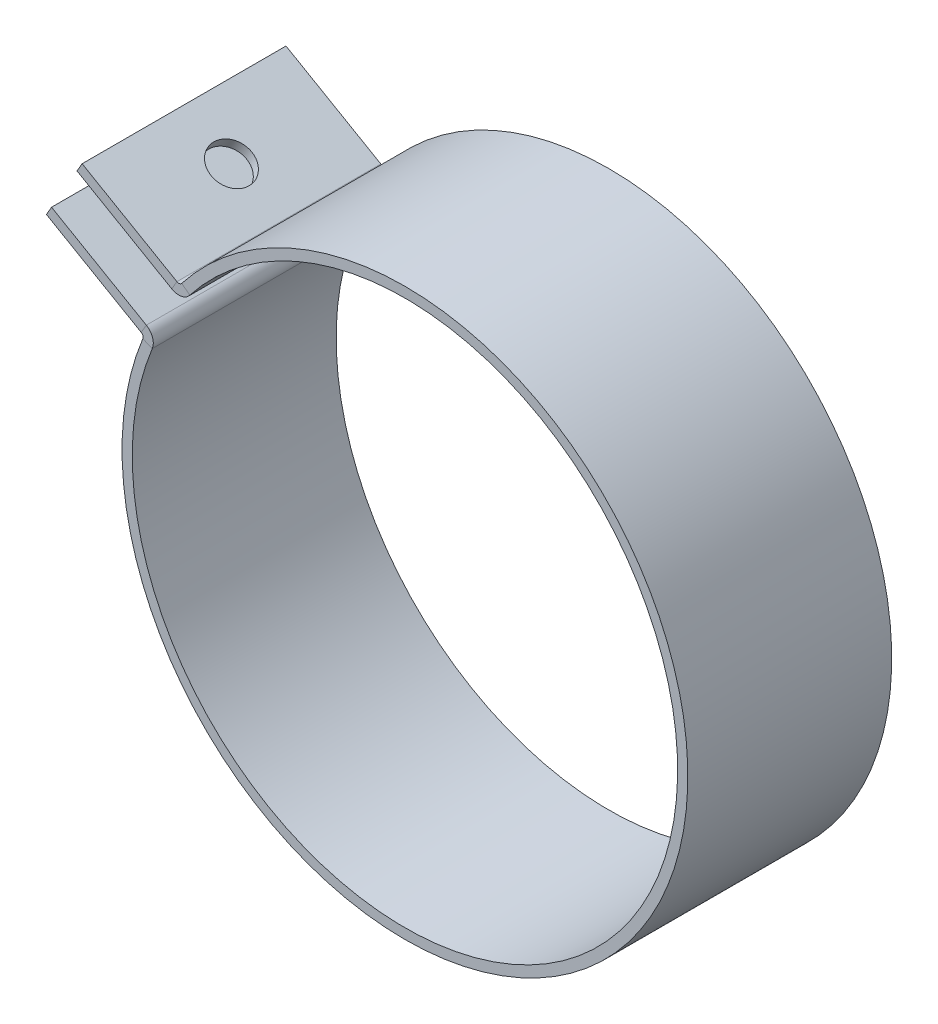
ISO-10303-21;
HEADER;
FILE_DESCRIPTION(('STEP AP214'),'2;1');
FILE_NAME('part.step','',(''),(''),'','','');
FILE_SCHEMA(('AUTOMOTIVE_DESIGN { 1 0 10303 214 1 1 1 1 }'));
ENDSEC;
DATA;
#1=APPLICATION_CONTEXT('core data for automotive mechanical design processes');
#2=APPLICATION_PROTOCOL_DEFINITION('international standard','automotive_design',2000,#1);
#3=PRODUCT_CONTEXT('',#1,'mechanical');
#4=PRODUCT('Part','Part','',(#3));
#5=PRODUCT_RELATED_PRODUCT_CATEGORY('part','',(#4));
#6=PRODUCT_DEFINITION_FORMATION('','',#4);
#7=PRODUCT_DEFINITION_CONTEXT('part definition',#1,'design');
#8=PRODUCT_DEFINITION('design','',#6,#7);
#9=PRODUCT_DEFINITION_SHAPE('','',#8);
#10=(LENGTH_UNIT() NAMED_UNIT(*) SI_UNIT(.MILLI.,.METRE.));
#11=(NAMED_UNIT(*) PLANE_ANGLE_UNIT() SI_UNIT($,.RADIAN.));
#12=(NAMED_UNIT(*) SI_UNIT($,.STERADIAN.) SOLID_ANGLE_UNIT());
#13=UNCERTAINTY_MEASURE_WITH_UNIT(LENGTH_MEASURE(1.E-05),#10,'distance_accuracy_value','');
#14=(GEOMETRIC_REPRESENTATION_CONTEXT(3) GLOBAL_UNCERTAINTY_ASSIGNED_CONTEXT((#13)) GLOBAL_UNIT_ASSIGNED_CONTEXT((#10,
#11,#12)) REPRESENTATION_CONTEXT('',''));
#15=CARTESIAN_POINT('',(0.,0.,0.));
#16=DIRECTION('',(0.,0.,1.));
#17=DIRECTION('',(1.,0.,0.));
#18=AXIS2_PLACEMENT_3D('',#15,#16,#17);
#19=CARTESIAN_POINT('',(-45.7392490613195,167.18107044998,40.));
#20=DIRECTION('',(0.,0.,1.));
#21=DIRECTION('',(1.,0.,0.));
#22=AXIS2_PLACEMENT_3D('',#19,#20,#21);
#23=PLANE('',#22);
#24=DIRECTION('',(0.499999999999991,0.866025403784444,0.));
#25=VECTOR('',#24,1.);
#26=CARTESIAN_POINT('',(-45.7392490613195,167.18107044998,40.));
#27=LINE('',#26,#25);
#28=CARTESIAN_POINT('',(-45.7392490613195,167.18107044998,40.));
#29=VERTEX_POINT('',#28);
#30=CARTESIAN_POINT('',(-44.7392490613195,168.913121257549,40.));
#31=VERTEX_POINT('',#30);
#32=EDGE_CURVE('E13',#29,#31,#27,.T.);
#33=ORIENTED_EDGE('',*,*,#32,.F.);
#34=CARTESIAN_POINT('',(-44.3709490613195,169.551035569977,40.));
#35=DIRECTION('',(0.,0.,1.));
#36=DIRECTION('',(1.,0.,0.));
#37=AXIS2_PLACEMENT_3D('',#34,#35,#36);
#38=CIRCLE('',#37,2.7366);
#39=CARTESIAN_POINT('',(-42.2117584416659,167.86970412496,40.));
#40=VERTEX_POINT('',#39);
#41=EDGE_CURVE('E258',#40,#29,#38,.F.);
#42=ORIENTED_EDGE('',*,*,#41,.F.);
#43=DIRECTION('',(0.789004830685348,-0.614386992989911,0.));
#44=VECTOR('',#43,1.);
#45=CARTESIAN_POINT('',(-43.7897681030368,169.09847811094,40.));
#46=LINE('',#45,#44);
#47=CARTESIAN_POINT('',(-43.7897681030368,169.09847811094,40.));
#48=VERTEX_POINT('',#47);
#49=EDGE_CURVE('E59',#48,#40,#46,.T.);
#50=ORIENTED_EDGE('',*,*,#49,.F.);
#51=CARTESIAN_POINT('',(-44.3709490613195,169.551035569977,40.));
#52=DIRECTION('',(0.,0.,1.));
#53=DIRECTION('',(1.,0.,0.));
#54=AXIS2_PLACEMENT_3D('',#51,#52,#53);
#55=CIRCLE('',#54,0.7366);
#56=EDGE_CURVE('E183',#48,#31,#55,.F.);
#57=ORIENTED_EDGE('',*,*,#56,.T.);
#58=EDGE_LOOP('',(#33,#42,#50,#57));
#59=FACE_BOUND('',#58,.T.);
#60=ADVANCED_FACE('F50',(#59),#23,.T.);
#61=CARTESIAN_POINT('',(-43.7897681030368,169.09847811094,40.));
#62=DIRECTION('',(0.,0.,1.));
#63=DIRECTION('',(1.,0.,0.));
#64=AXIS2_PLACEMENT_3D('',#61,#62,#63);
#65=PLANE('',#64);
#66=DIRECTION('',(-0.866025403784444,0.49999999999999,0.));
#67=VECTOR('',#66,1.);
#68=CARTESIAN_POINT('',(-43.6295729440455,165.963048375769,40.));
#69=LINE('',#68,#67);
#70=CARTESIAN_POINT('',(-64.3363094478901,177.918088270302,40.));
#71=VERTEX_POINT('',#70);
#72=EDGE_CURVE('E262',#29,#71,#69,.T.);
#73=ORIENTED_EDGE('',*,*,#72,.F.);
#74=ORIENTED_EDGE('',*,*,#32,.T.);
#75=DIRECTION('',(-0.866025403784444,0.49999999999999,0.));
#76=VECTOR('',#75,1.);
#77=CARTESIAN_POINT('',(-42.6295729440455,167.695099183338,40.));
#78=LINE('',#77,#76);
#79=CARTESIAN_POINT('',(-63.3363094478903,179.650139077871,40.));
#80=VERTEX_POINT('',#79);
#81=EDGE_CURVE('E119',#31,#80,#78,.T.);
#82=ORIENTED_EDGE('',*,*,#81,.T.);
#83=DIRECTION('',(0.499999999999993,0.866025403784442,0.));
#84=VECTOR('',#83,1.);
#85=CARTESIAN_POINT('',(-64.3363094478901,177.918088270302,40.));
#86=LINE('',#85,#84);
#87=EDGE_CURVE('E500',#71,#80,#86,.T.);
#88=ORIENTED_EDGE('',*,*,#87,.F.);
#89=EDGE_LOOP('',(#73,#74,#82,#88));
#90=FACE_BOUND('',#89,.T.);
#91=ADVANCED_FACE('F311',(#90),#65,.T.);
#92=CARTESIAN_POINT('',(-42.2117584416659,167.86970412496,0.));
#93=DIRECTION('',(0.,0.,-1.));
#94=DIRECTION('',(-1.,0.,0.));
#95=AXIS2_PLACEMENT_3D('',#92,#93,#94);
#96=PLANE('',#95);
#97=DIRECTION('',(-0.789004830685348,0.614386992989911,0.));
#98=VECTOR('',#97,1.);
#99=CARTESIAN_POINT('',(-42.2117584416659,167.86970412496,0.));
#100=LINE('',#99,#98);
#101=CARTESIAN_POINT('',(-42.2117584416659,167.86970412496,0.));
#102=VERTEX_POINT('',#101);
#103=CARTESIAN_POINT('',(-43.7897681030368,169.09847811094,0.));
#104=VERTEX_POINT('',#103);
#105=EDGE_CURVE('E106',#102,#104,#100,.T.);
#106=ORIENTED_EDGE('',*,*,#105,.F.);
#107=CARTESIAN_POINT('',(-44.3709490613195,169.551035569977,0.));
#108=DIRECTION('',(0.,0.,1.));
#109=DIRECTION('',(1.,0.,0.));
#110=AXIS2_PLACEMENT_3D('',#107,#108,#109);
#111=CIRCLE('',#110,2.7366);
#112=CARTESIAN_POINT('',(-45.7392490613195,167.18107044998,0.));
#113=VERTEX_POINT('',#112);
#114=EDGE_CURVE('E199',#102,#113,#111,.F.);
#115=ORIENTED_EDGE('',*,*,#114,.T.);
#116=DIRECTION('',(-0.499999999999991,-0.866025403784444,0.));
#117=VECTOR('',#116,1.);
#118=CARTESIAN_POINT('',(-44.7392490613195,168.913121257549,0.));
#119=LINE('',#118,#117);
#120=CARTESIAN_POINT('',(-44.7392490613195,168.913121257549,0.));
#121=VERTEX_POINT('',#120);
#122=EDGE_CURVE('E113',#121,#113,#119,.T.);
#123=ORIENTED_EDGE('',*,*,#122,.F.);
#124=CARTESIAN_POINT('',(-44.3709490613195,169.551035569977,0.));
#125=DIRECTION('',(0.,0.,1.));
#126=DIRECTION('',(1.,0.,0.));
#127=AXIS2_PLACEMENT_3D('',#124,#125,#126);
#128=CIRCLE('',#127,0.7366);
#129=EDGE_CURVE('E218',#104,#121,#128,.F.);
#130=ORIENTED_EDGE('',*,*,#129,.F.);
#131=EDGE_LOOP('',(#106,#115,#123,#130));
#132=FACE_BOUND('',#131,.T.);
#133=ADVANCED_FACE('F315',(#132),#96,.T.);
#134=CARTESIAN_POINT('',(-44.7392490613195,168.913121257549,0.));
#135=DIRECTION('',(0.,0.,-1.));
#136=DIRECTION('',(-1.,0.,0.));
#137=AXIS2_PLACEMENT_3D('',#134,#135,#136);
#138=PLANE('',#137);
#139=CARTESIAN_POINT('',(0.,135.,0.));
#140=DIRECTION('',(0.,0.,1.));
#141=DIRECTION('',(1.,0.,0.));
#142=AXIS2_PLACEMENT_3D('',#139,#140,#141);
#143=CIRCLE('',#142,53.5);
#144=CARTESIAN_POINT('',(-49.5718780079271,155.121603086414,0.));
#145=VERTEX_POINT('',#144);
#146=EDGE_CURVE('E201',#145,#102,#143,.T.);
#147=ORIENTED_EDGE('',*,*,#146,.T.);
#148=ORIENTED_EDGE('',*,*,#105,.T.);
#149=CARTESIAN_POINT('',(0.,135.,0.));
#150=DIRECTION('',(0.,0.,1.));
#151=DIRECTION('',(1.,0.,0.));
#152=AXIS2_PLACEMENT_3D('',#149,#150,#151);
#153=CIRCLE('',#152,55.5);
#154=CARTESIAN_POINT('',(-51.4250323259805,155.873812547589,0.));
#155=VERTEX_POINT('',#154);
#156=EDGE_CURVE('E216',#155,#104,#153,.T.);
#157=ORIENTED_EDGE('',*,*,#156,.F.);
#158=DIRECTION('',(0.926577159026677,-0.376104730587175,0.));
#159=VECTOR('',#158,1.);
#160=CARTESIAN_POINT('',(-51.4250323259805,155.873812547589,0.));
#161=LINE('',#160,#159);
#162=EDGE_CURVE('E244',#155,#145,#161,.T.);
#163=ORIENTED_EDGE('',*,*,#162,.T.);
#164=EDGE_LOOP('',(#147,#148,#157,#163));
#165=FACE_BOUND('',#164,.T.);
#166=ADVANCED_FACE('F288',(#165),#138,.T.);
#167=CARTESIAN_POINT('',(-49.5718780079271,155.121603086414,40.));
#168=DIRECTION('',(0.,0.,1.));
#169=DIRECTION('',(1.,0.,0.));
#170=AXIS2_PLACEMENT_3D('',#167,#168,#169);
#171=PLANE('',#170);
#172=DIRECTION('',(-0.926577159026677,0.376104730587175,0.));
#173=VECTOR('',#172,1.);
#174=CARTESIAN_POINT('',(-49.5718780079271,155.121603086414,40.));
#175=LINE('',#174,#173);
#176=CARTESIAN_POINT('',(-49.5718780079271,155.121603086414,40.));
#177=VERTEX_POINT('',#176);
#178=CARTESIAN_POINT('',(-51.4250323259805,155.873812547589,40.));
#179=VERTEX_POINT('',#178);
#180=EDGE_CURVE('E147',#177,#179,#175,.T.);
#181=ORIENTED_EDGE('',*,*,#180,.F.);
#182=CARTESIAN_POINT('',(-52.1075490613195,156.150851292139,40.));
#183=DIRECTION('',(0.,0.,1.));
#184=DIRECTION('',(1.,0.,0.));
#185=AXIS2_PLACEMENT_3D('',#182,#183,#184);
#186=CIRCLE('',#185,2.7366);
#187=CARTESIAN_POINT('',(-50.7392490613195,158.520816412136,40.));
#188=VERTEX_POINT('',#187);
#189=EDGE_CURVE('E265',#188,#177,#186,.F.);
#190=ORIENTED_EDGE('',*,*,#189,.F.);
#191=DIRECTION('',(0.499999999999999,0.866025403784439,0.));
#192=VECTOR('',#191,1.);
#193=CARTESIAN_POINT('',(-51.7392490613195,156.788765604567,40.));
#194=LINE('',#193,#192);
#195=CARTESIAN_POINT('',(-51.7392490613195,156.788765604567,40.));
#196=VERTEX_POINT('',#195);
#197=EDGE_CURVE('E159',#196,#188,#194,.T.);
#198=ORIENTED_EDGE('',*,*,#197,.F.);
#199=CARTESIAN_POINT('',(-52.1075490613195,156.150851292139,40.));
#200=DIRECTION('',(0.,0.,1.));
#201=DIRECTION('',(1.,0.,0.));
#202=AXIS2_PLACEMENT_3D('',#199,#200,#201);
#203=CIRCLE('',#202,0.7366);
#204=EDGE_CURVE('E162',#196,#179,#203,.F.);
#205=ORIENTED_EDGE('',*,*,#204,.T.);
#206=EDGE_LOOP('',(#181,#190,#198,#205));
#207=FACE_BOUND('',#206,.T.);
#208=ADVANCED_FACE('F164',(#207),#171,.T.);
#209=CARTESIAN_POINT('',(-51.7392490613195,156.788765604567,40.));
#210=DIRECTION('',(0.,0.,1.));
#211=DIRECTION('',(1.,0.,0.));
#212=AXIS2_PLACEMENT_3D('',#209,#210,#211);
#213=PLANE('',#212);
#214=CARTESIAN_POINT('',(0.,135.,40.));
#215=DIRECTION('',(0.,0.,1.));
#216=DIRECTION('',(1.,0.,0.));
#217=AXIS2_PLACEMENT_3D('',#214,#215,#216);
#218=CIRCLE('',#217,53.5);
#219=EDGE_CURVE('E154',#177,#40,#218,.T.);
#220=ORIENTED_EDGE('',*,*,#219,.F.);
#221=ORIENTED_EDGE('',*,*,#180,.T.);
#222=CARTESIAN_POINT('',(0.,135.,40.));
#223=DIRECTION('',(0.,0.,1.));
#224=DIRECTION('',(1.,0.,0.));
#225=AXIS2_PLACEMENT_3D('',#222,#223,#224);
#226=CIRCLE('',#225,55.5);
#227=EDGE_CURVE('E151',#179,#48,#226,.T.);
#228=ORIENTED_EDGE('',*,*,#227,.T.);
#229=ORIENTED_EDGE('',*,*,#49,.T.);
#230=EDGE_LOOP('',(#220,#221,#228,#229));
#231=FACE_BOUND('',#230,.T.);
#232=ADVANCED_FACE('F149',(#231),#213,.T.);
#233=CARTESIAN_POINT('',(-50.7392490613195,158.520816412136,0.));
#234=DIRECTION('',(0.,0.,-1.));
#235=DIRECTION('',(-1.,0.,0.));
#236=AXIS2_PLACEMENT_3D('',#233,#234,#235);
#237=PLANE('',#236);
#238=DIRECTION('',(-0.499999999999999,-0.866025403784439,0.));
#239=VECTOR('',#238,1.);
#240=CARTESIAN_POINT('',(-50.7392490613195,158.520816412136,0.));
#241=LINE('',#240,#239);
#242=CARTESIAN_POINT('',(-50.7392490613195,158.520816412136,0.));
#243=VERTEX_POINT('',#242);
#244=CARTESIAN_POINT('',(-51.7392490613195,156.788765604567,0.));
#245=VERTEX_POINT('',#244);
#246=EDGE_CURVE('E246',#243,#245,#241,.T.);
#247=ORIENTED_EDGE('',*,*,#246,.F.);
#248=CARTESIAN_POINT('',(-52.1075490613195,156.150851292139,0.));
#249=DIRECTION('',(0.,0.,1.));
#250=DIRECTION('',(1.,0.,0.));
#251=AXIS2_PLACEMENT_3D('',#248,#249,#250);
#252=CIRCLE('',#251,2.7366);
#253=EDGE_CURVE('E203',#243,#145,#252,.F.);
#254=ORIENTED_EDGE('',*,*,#253,.T.);
#255=ORIENTED_EDGE('',*,*,#162,.F.);
#256=CARTESIAN_POINT('',(-52.1075490613195,156.150851292139,0.));
#257=DIRECTION('',(0.,0.,1.));
#258=DIRECTION('',(1.,0.,0.));
#259=AXIS2_PLACEMENT_3D('',#256,#257,#258);
#260=CIRCLE('',#259,0.7366);
#261=EDGE_CURVE('E175',#245,#155,#260,.F.);
#262=ORIENTED_EDGE('',*,*,#261,.F.);
#263=EDGE_LOOP('',(#247,#254,#255,#262));
#264=FACE_BOUND('',#263,.T.);
#265=ADVANCED_FACE('F286',(#264),#237,.T.);
#266=CARTESIAN_POINT('',(-51.4250323259805,155.873812547589,0.));
#267=DIRECTION('',(0.,0.,-1.));
#268=DIRECTION('',(-1.,0.,0.));
#269=AXIS2_PLACEMENT_3D('',#266,#267,#268);
#270=PLANE('',#269);
#271=DIRECTION('',(0.86602540378444,-0.499999999999997,0.));
#272=VECTOR('',#271,1.);
#273=CARTESIAN_POINT('',(-69.3363094478902,169.257834232458,0.));
#274=LINE('',#273,#272);
#275=CARTESIAN_POINT('',(-69.3363094478902,169.257834232458,0.));
#276=VERTEX_POINT('',#275);
#277=EDGE_CURVE('E206',#276,#243,#274,.T.);
#278=ORIENTED_EDGE('',*,*,#277,.T.);
#279=ORIENTED_EDGE('',*,*,#246,.T.);
#280=DIRECTION('',(0.86602540378444,-0.499999999999997,0.));
#281=VECTOR('',#280,1.);
#282=CARTESIAN_POINT('',(-70.3363094478902,167.525783424889,0.));
#283=LINE('',#282,#281);
#284=CARTESIAN_POINT('',(-70.3363094478902,167.525783424889,0.));
#285=VERTEX_POINT('',#284);
#286=EDGE_CURVE('E212',#285,#245,#283,.T.);
#287=ORIENTED_EDGE('',*,*,#286,.F.);
#288=DIRECTION('',(0.499999999999998,0.866025403784439,0.));
#289=VECTOR('',#288,1.);
#290=CARTESIAN_POINT('',(-70.3363094478902,167.525783424889,0.));
#291=LINE('',#290,#289);
#292=EDGE_CURVE('E209',#285,#276,#291,.T.);
#293=ORIENTED_EDGE('',*,*,#292,.T.);
#294=EDGE_LOOP('',(#278,#279,#287,#293));
#295=FACE_BOUND('',#294,.T.);
#296=ADVANCED_FACE('F298',(#295),#270,.T.);
#297=CARTESIAN_POINT('',(-42.6295729440455,167.695099183338,40.));
#298=DIRECTION('',(-0.49999999999999,-0.866025403784444,0.));
#299=DIRECTION('',(0.866025403784444,-0.49999999999999,0.));
#300=AXIS2_PLACEMENT_3D('',#297,#298,#299);
#301=PLANE('',#300);
#302=CARTESIAN_POINT('',(-54.0377792546047,174.28163016771,20.));
#303=DIRECTION('',(0.499999999999992,0.866025403784443,0.));
#304=DIRECTION('',(-0.866025403784443,0.499999999999992,0.));
#305=AXIS2_PLACEMENT_3D('',#302,#303,#304);
#306=CIRCLE('',#305,3.99999999999998);
#307=CARTESIAN_POINT('',(-57.5018808697425,176.28163016771,20.));
#308=VERTEX_POINT('',#307);
#309=EDGE_CURVE('E491',#308,#308,#306,.T.);
#310=ORIENTED_EDGE('',*,*,#309,.F.);
#311=EDGE_LOOP('',(#310));
#312=FACE_BOUND('',#311,.T.);
#313=DIRECTION('',(-0.866025403784444,0.49999999999999,0.));
#314=VECTOR('',#313,1.);
#315=CARTESIAN_POINT('',(-42.6295729440455,167.695099183338,0.));
#316=LINE('',#315,#314);
#317=CARTESIAN_POINT('',(-63.3363094478903,179.650139077871,0.));
#318=VERTEX_POINT('',#317);
#319=EDGE_CURVE('E189',#121,#318,#316,.T.);
#320=ORIENTED_EDGE('',*,*,#319,.T.);
#321=DIRECTION('',(0.,0.,-1.));
#322=VECTOR('',#321,1.);
#323=CARTESIAN_POINT('',(-63.3363094478903,179.650139077871,40.));
#324=LINE('',#323,#322);
#325=EDGE_CURVE('E242',#80,#318,#324,.T.);
#326=ORIENTED_EDGE('',*,*,#325,.F.);
#327=ORIENTED_EDGE('',*,*,#81,.F.);
#328=DIRECTION('',(0.,0.,-1.));
#329=VECTOR('',#328,1.);
#330=CARTESIAN_POINT('',(-44.7392490613195,168.913121257549,40.));
#331=LINE('',#330,#329);
#332=EDGE_CURVE('E185',#31,#121,#331,.T.);
#333=ORIENTED_EDGE('',*,*,#332,.T.);
#334=EDGE_LOOP('',(#320,#326,#327,#333));
#335=FACE_BOUND('',#334,.T.);
#336=ADVANCED_FACE('F300',(#312,#335),#301,.F.);
#337=CARTESIAN_POINT('',(-64.3363094478901,177.918088270302,40.));
#338=DIRECTION('',(-0.866025403784442,0.499999999999993,0.));
#339=DIRECTION('',(-0.499999999999993,-0.866025403784442,0.));
#340=AXIS2_PLACEMENT_3D('',#337,#338,#339);
#341=PLANE('',#340);
#342=DIRECTION('',(0.499999999999993,0.866025403784442,0.));
#343=VECTOR('',#342,1.);
#344=CARTESIAN_POINT('',(-64.3363094478901,177.918088270302,0.));
#345=LINE('',#344,#343);
#346=CARTESIAN_POINT('',(-64.3363094478901,177.918088270302,0.));
#347=VERTEX_POINT('',#346);
#348=EDGE_CURVE('E192',#347,#318,#345,.T.);
#349=ORIENTED_EDGE('',*,*,#348,.F.);
#350=DIRECTION('',(0.,0.,-1.));
#351=VECTOR('',#350,1.);
#352=CARTESIAN_POINT('',(-64.3363094478901,177.918088270302,40.));
#353=LINE('',#352,#351);
#354=EDGE_CURVE('E240',#71,#347,#353,.T.);
#355=ORIENTED_EDGE('',*,*,#354,.F.);
#356=ORIENTED_EDGE('',*,*,#87,.T.);
#357=ORIENTED_EDGE('',*,*,#325,.T.);
#358=EDGE_LOOP('',(#349,#355,#356,#357));
#359=FACE_BOUND('',#358,.T.);
#360=ADVANCED_FACE('F306',(#359),#341,.T.);
#361=CARTESIAN_POINT('',(-43.6295729440455,165.963048375769,40.));
#362=DIRECTION('',(-0.49999999999999,-0.866025403784444,0.));
#363=DIRECTION('',(0.866025403784444,-0.49999999999999,0.));
#364=AXIS2_PLACEMENT_3D('',#361,#362,#363);
#365=PLANE('',#364);
#366=CARTESIAN_POINT('',(-55.0377792546048,172.549579360141,20.));
#367=DIRECTION('',(-0.49999999999999,-0.866025403784444,0.));
#368=DIRECTION('',(0.866025403784444,-0.49999999999999,0.));
#369=AXIS2_PLACEMENT_3D('',#366,#367,#368);
#370=CIRCLE('',#369,3.99999999999998);
#371=CARTESIAN_POINT('',(-51.5736776394671,170.549579360141,20.));
#372=VERTEX_POINT('',#371);
#373=EDGE_CURVE('E193',#372,#372,#370,.T.);
#374=ORIENTED_EDGE('',*,*,#373,.F.);
#375=EDGE_LOOP('',(#374));
#376=FACE_BOUND('',#375,.T.);
#377=DIRECTION('',(-0.866025403784444,0.49999999999999,0.));
#378=VECTOR('',#377,1.);
#379=CARTESIAN_POINT('',(-43.6295729440455,165.963048375769,0.));
#380=LINE('',#379,#378);
#381=EDGE_CURVE('E196',#113,#347,#380,.T.);
#382=ORIENTED_EDGE('',*,*,#381,.F.);
#383=DIRECTION('',(0.,0.,-1.));
#384=VECTOR('',#383,1.);
#385=CARTESIAN_POINT('',(-45.7392490613195,167.18107044998,40.));
#386=LINE('',#385,#384);
#387=EDGE_CURVE('E237',#29,#113,#386,.T.);
#388=ORIENTED_EDGE('',*,*,#387,.F.);
#389=ORIENTED_EDGE('',*,*,#72,.T.);
#390=ORIENTED_EDGE('',*,*,#354,.T.);
#391=EDGE_LOOP('',(#382,#388,#389,#390));
#392=FACE_BOUND('',#391,.T.);
#393=ADVANCED_FACE('F358',(#376,#392),#365,.T.);
#394=CARTESIAN_POINT('',(-44.3709490613195,169.551035569977,40.));
#395=DIRECTION('',(0.,0.,-1.));
#396=DIRECTION('',(-1.,0.,0.));
#397=AXIS2_PLACEMENT_3D('',#394,#395,#396);
#398=CYLINDRICAL_SURFACE('',#397,2.7366);
#399=ORIENTED_EDGE('',*,*,#114,.F.);
#400=DIRECTION('',(0.,0.,-1.));
#401=VECTOR('',#400,1.);
#402=CARTESIAN_POINT('',(-42.2117584416659,167.86970412496,40.));
#403=LINE('',#402,#401);
#404=EDGE_CURVE('E234',#40,#102,#403,.T.);
#405=ORIENTED_EDGE('',*,*,#404,.F.);
#406=ORIENTED_EDGE('',*,*,#41,.T.);
#407=ORIENTED_EDGE('',*,*,#387,.T.);
#408=EDGE_LOOP('',(#399,#405,#406,#407));
#409=FACE_BOUND('',#408,.T.);
#410=ADVANCED_FACE('F257',(#409),#398,.T.);
#411=CARTESIAN_POINT('',(0.,135.,40.));
#412=DIRECTION('',(0.,0.,-1.));
#413=DIRECTION('',(-1.,0.,0.));
#414=AXIS2_PLACEMENT_3D('',#411,#412,#413);
#415=CYLINDRICAL_SURFACE('',#414,53.5);
#416=ORIENTED_EDGE('',*,*,#146,.F.);
#417=DIRECTION('',(0.,0.,-1.));
#418=VECTOR('',#417,1.);
#419=CARTESIAN_POINT('',(-49.5718780079271,155.121603086414,40.));
#420=LINE('',#419,#418);
#421=EDGE_CURVE('E231',#177,#145,#420,.T.);
#422=ORIENTED_EDGE('',*,*,#421,.F.);
#423=ORIENTED_EDGE('',*,*,#219,.T.);
#424=ORIENTED_EDGE('',*,*,#404,.T.);
#425=EDGE_LOOP('',(#416,#422,#423,#424));
#426=FACE_BOUND('',#425,.T.);
#427=ADVANCED_FACE('F264',(#426),#415,.F.);
#428=CARTESIAN_POINT('',(-52.1075490613195,156.150851292139,40.));
#429=DIRECTION('',(0.,0.,-1.));
#430=DIRECTION('',(-1.,0.,0.));
#431=AXIS2_PLACEMENT_3D('',#428,#429,#430);
#432=CYLINDRICAL_SURFACE('',#431,2.7366);
#433=ORIENTED_EDGE('',*,*,#253,.F.);
#434=DIRECTION('',(0.,0.,-1.));
#435=VECTOR('',#434,1.);
#436=CARTESIAN_POINT('',(-50.7392490613195,158.520816412136,40.));
#437=LINE('',#436,#435);
#438=EDGE_CURVE('E228',#188,#243,#437,.T.);
#439=ORIENTED_EDGE('',*,*,#438,.F.);
#440=ORIENTED_EDGE('',*,*,#189,.T.);
#441=ORIENTED_EDGE('',*,*,#421,.T.);
#442=EDGE_LOOP('',(#433,#439,#440,#441));
#443=FACE_BOUND('',#442,.T.);
#444=ADVANCED_FACE('F290',(#443),#432,.T.);
#445=CARTESIAN_POINT('',(-69.3363094478902,169.257834232458,40.));
#446=DIRECTION('',(0.499999999999997,0.86602540378444,0.));
#447=DIRECTION('',(-0.86602540378444,0.499999999999997,0.));
#448=AXIS2_PLACEMENT_3D('',#445,#446,#447);
#449=PLANE('',#448);
#450=CARTESIAN_POINT('',(-60.0377792546046,163.889325322297,20.));
#451=DIRECTION('',(0.499999999999997,0.86602540378444,0.));
#452=DIRECTION('',(-0.86602540378444,0.499999999999997,0.));
#453=AXIS2_PLACEMENT_3D('',#450,#451,#452);
#454=CIRCLE('',#453,3.99999999999998);
#455=CARTESIAN_POINT('',(-63.5018808697424,165.889325322297,20.));
#456=VERTEX_POINT('',#455);
#457=EDGE_CURVE('E494',#456,#456,#454,.T.);
#458=ORIENTED_EDGE('',*,*,#457,.F.);
#459=EDGE_LOOP('',(#458));
#460=FACE_BOUND('',#459,.T.);
#461=ORIENTED_EDGE('',*,*,#277,.F.);
#462=DIRECTION('',(0.,0.,-1.));
#463=VECTOR('',#462,1.);
#464=CARTESIAN_POINT('',(-69.3363094478902,169.257834232458,40.));
#465=LINE('',#464,#463);
#466=CARTESIAN_POINT('',(-69.3363094478902,169.257834232458,40.));
#467=VERTEX_POINT('',#466);
#468=EDGE_CURVE('E226',#467,#276,#465,.T.);
#469=ORIENTED_EDGE('',*,*,#468,.F.);
#470=DIRECTION('',(0.86602540378444,-0.499999999999997,0.));
#471=VECTOR('',#470,1.);
#472=CARTESIAN_POINT('',(-69.3363094478902,169.257834232458,40.));
#473=LINE('',#472,#471);
#474=EDGE_CURVE('E267',#467,#188,#473,.T.);
#475=ORIENTED_EDGE('',*,*,#474,.T.);
#476=ORIENTED_EDGE('',*,*,#438,.T.);
#477=EDGE_LOOP('',(#461,#469,#475,#476));
#478=FACE_BOUND('',#477,.T.);
#479=ADVANCED_FACE('F293',(#460,#478),#449,.T.);
#480=CARTESIAN_POINT('',(-70.3363094478902,167.525783424889,40.));
#481=DIRECTION('',(-0.866025403784439,0.499999999999998,0.));
#482=DIRECTION('',(-0.499999999999998,-0.866025403784439,0.));
#483=AXIS2_PLACEMENT_3D('',#480,#481,#482);
#484=PLANE('',#483);
#485=ORIENTED_EDGE('',*,*,#292,.F.);
#486=DIRECTION('',(0.,0.,-1.));
#487=VECTOR('',#486,1.);
#488=CARTESIAN_POINT('',(-70.3363094478902,167.525783424889,40.));
#489=LINE('',#488,#487);
#490=CARTESIAN_POINT('',(-70.3363094478902,167.525783424889,40.));
#491=VERTEX_POINT('',#490);
#492=EDGE_CURVE('E224',#491,#285,#489,.T.);
#493=ORIENTED_EDGE('',*,*,#492,.F.);
#494=DIRECTION('',(0.499999999999998,0.866025403784439,0.));
#495=VECTOR('',#494,1.);
#496=CARTESIAN_POINT('',(-70.3363094478902,167.525783424889,40.));
#497=LINE('',#496,#495);
#498=EDGE_CURVE('E273',#491,#467,#497,.T.);
#499=ORIENTED_EDGE('',*,*,#498,.T.);
#500=ORIENTED_EDGE('',*,*,#468,.T.);
#501=EDGE_LOOP('',(#485,#493,#499,#500));
#502=FACE_BOUND('',#501,.T.);
#503=ADVANCED_FACE('F296',(#502),#484,.T.);
#504=CARTESIAN_POINT('',(-70.3363094478902,167.525783424889,40.));
#505=DIRECTION('',(0.499999999999997,0.86602540378444,0.));
#506=DIRECTION('',(-0.86602540378444,0.499999999999997,0.));
#507=AXIS2_PLACEMENT_3D('',#504,#505,#506);
#508=PLANE('',#507);
#509=CARTESIAN_POINT('',(-61.0377792546046,162.157274514728,20.));
#510=DIRECTION('',(0.499999999999997,0.86602540378444,0.));
#511=DIRECTION('',(-0.86602540378444,0.499999999999997,0.));
#512=AXIS2_PLACEMENT_3D('',#509,#510,#511);
#513=CIRCLE('',#512,3.99999999999998);
#514=CARTESIAN_POINT('',(-64.5018808697424,164.157274514728,20.));
#515=VERTEX_POINT('',#514);
#516=EDGE_CURVE('E53',#515,#515,#513,.T.);
#517=ORIENTED_EDGE('',*,*,#516,.T.);
#518=EDGE_LOOP('',(#517));
#519=FACE_BOUND('',#518,.T.);
#520=ORIENTED_EDGE('',*,*,#286,.T.);
#521=DIRECTION('',(0.,0.,-1.));
#522=VECTOR('',#521,1.);
#523=CARTESIAN_POINT('',(-51.7392490613195,156.788765604567,40.));
#524=LINE('',#523,#522);
#525=EDGE_CURVE('E177',#196,#245,#524,.T.);
#526=ORIENTED_EDGE('',*,*,#525,.F.);
#527=DIRECTION('',(0.86602540378444,-0.499999999999997,0.));
#528=VECTOR('',#527,1.);
#529=CARTESIAN_POINT('',(-70.3363094478902,167.525783424889,40.));
#530=LINE('',#529,#528);
#531=EDGE_CURVE('E168',#491,#196,#530,.T.);
#532=ORIENTED_EDGE('',*,*,#531,.F.);
#533=ORIENTED_EDGE('',*,*,#492,.T.);
#534=EDGE_LOOP('',(#520,#526,#532,#533));
#535=FACE_BOUND('',#534,.T.);
#536=ADVANCED_FACE('F283',(#519,#535),#508,.F.);
#537=CARTESIAN_POINT('',(-52.1075490613195,156.150851292139,40.));
#538=DIRECTION('',(0.,0.,-1.));
#539=DIRECTION('',(-1.,0.,0.));
#540=AXIS2_PLACEMENT_3D('',#537,#538,#539);
#541=CYLINDRICAL_SURFACE('',#540,0.7366);
#542=ORIENTED_EDGE('',*,*,#261,.T.);
#543=DIRECTION('',(0.,0.,-1.));
#544=VECTOR('',#543,1.);
#545=CARTESIAN_POINT('',(-51.4250323259805,155.873812547589,40.));
#546=LINE('',#545,#544);
#547=EDGE_CURVE('E172',#179,#155,#546,.T.);
#548=ORIENTED_EDGE('',*,*,#547,.F.);
#549=ORIENTED_EDGE('',*,*,#204,.F.);
#550=ORIENTED_EDGE('',*,*,#525,.T.);
#551=EDGE_LOOP('',(#542,#548,#549,#550));
#552=FACE_BOUND('',#551,.T.);
#553=ADVANCED_FACE('F173',(#552),#541,.F.);
#554=CARTESIAN_POINT('',(0.,135.,40.));
#555=DIRECTION('',(0.,0.,-1.));
#556=DIRECTION('',(-1.,0.,0.));
#557=AXIS2_PLACEMENT_3D('',#554,#555,#556);
#558=CYLINDRICAL_SURFACE('',#557,55.5);
#559=ORIENTED_EDGE('',*,*,#156,.T.);
#560=DIRECTION('',(0.,0.,-1.));
#561=VECTOR('',#560,1.);
#562=CARTESIAN_POINT('',(-43.7897681030368,169.09847811094,40.));
#563=LINE('',#562,#561);
#564=EDGE_CURVE('E178',#48,#104,#563,.T.);
#565=ORIENTED_EDGE('',*,*,#564,.F.);
#566=ORIENTED_EDGE('',*,*,#227,.F.);
#567=ORIENTED_EDGE('',*,*,#547,.T.);
#568=EDGE_LOOP('',(#559,#565,#566,#567));
#569=FACE_BOUND('',#568,.T.);
#570=ADVANCED_FACE('F180',(#569),#558,.T.);
#571=CARTESIAN_POINT('',(-44.3709490613195,169.551035569977,40.));
#572=DIRECTION('',(0.,0.,-1.));
#573=DIRECTION('',(-1.,0.,0.));
#574=AXIS2_PLACEMENT_3D('',#571,#572,#573);
#575=CYLINDRICAL_SURFACE('',#574,0.7366);
#576=ORIENTED_EDGE('',*,*,#129,.T.);
#577=ORIENTED_EDGE('',*,*,#332,.F.);
#578=ORIENTED_EDGE('',*,*,#56,.F.);
#579=ORIENTED_EDGE('',*,*,#564,.T.);
#580=EDGE_LOOP('',(#576,#577,#578,#579));
#581=FACE_BOUND('',#580,.T.);
#582=ADVANCED_FACE('F438',(#581),#575,.F.);
#583=CARTESIAN_POINT('',(-44.3709490613195,169.551035569977,40.));
#584=DIRECTION('',(0.,0.,1.));
#585=DIRECTION('',(1.,0.,0.));
#586=AXIS2_PLACEMENT_3D('',#583,#584,#585);
#587=PLANE('',#586);
#588=ORIENTED_EDGE('',*,*,#531,.T.);
#589=ORIENTED_EDGE('',*,*,#197,.T.);
#590=ORIENTED_EDGE('',*,*,#474,.F.);
#591=ORIENTED_EDGE('',*,*,#498,.F.);
#592=EDGE_LOOP('',(#588,#589,#590,#591));
#593=FACE_BOUND('',#592,.T.);
#594=ADVANCED_FACE('F279',(#593),#587,.T.);
#595=CARTESIAN_POINT('',(-44.3709490613195,169.551035569977,0.));
#596=DIRECTION('',(0.,0.,1.));
#597=DIRECTION('',(1.,0.,0.));
#598=AXIS2_PLACEMENT_3D('',#595,#596,#597);
#599=PLANE('',#598);
#600=ORIENTED_EDGE('',*,*,#319,.F.);
#601=ORIENTED_EDGE('',*,*,#122,.T.);
#602=ORIENTED_EDGE('',*,*,#381,.T.);
#603=ORIENTED_EDGE('',*,*,#348,.T.);
#604=EDGE_LOOP('',(#600,#601,#602,#603));
#605=FACE_BOUND('',#604,.T.);
#606=ADVANCED_FACE('F456',(#605),#599,.F.);
#607=CARTESIAN_POINT('',(-99.1540615715948,96.1379369460605,20.));
#608=DIRECTION('',(0.499999999999992,0.866025403784443,0.));
#609=DIRECTION('',(-0.866025403784443,0.499999999999992,0.));
#610=AXIS2_PLACEMENT_3D('',#607,#608,#609);
#611=CYLINDRICAL_SURFACE('',#610,3.99999999999998);
#612=ORIENTED_EDGE('',*,*,#457,.T.);
#613=EDGE_LOOP('',(#612));
#614=FACE_BOUND('',#613,.T.);
#615=ORIENTED_EDGE('',*,*,#516,.F.);
#616=EDGE_LOOP('',(#615));
#617=FACE_BOUND('',#616,.T.);
#618=ADVANCED_FACE('F464',(#614,#617),#611,.F.);
#619=ORIENTED_EDGE('',*,*,#373,.T.);
#620=EDGE_LOOP('',(#619));
#621=FACE_BOUND('',#620,.T.);
#622=ORIENTED_EDGE('',*,*,#309,.T.);
#623=EDGE_LOOP('',(#622));
#624=FACE_BOUND('',#623,.T.);
#625=ADVANCED_FACE('F474',(#621,#624),#611,.F.);
#626=CLOSED_SHELL('',(#60,#91,#133,#166,#208,#232,#265,#296,#336,#360,#393,#410,#427,#444,#479,
#503,#536,#553,#570,#582,#594,#606,#618,#625));
#627=MANIFOLD_SOLID_BREP('B2',#626);
#628=ADVANCED_BREP_SHAPE_REPRESENTATION('',(#18,#627),#14);
#629=SHAPE_DEFINITION_REPRESENTATION(#9,#628);
ENDSEC;
END-ISO-10303-21;
